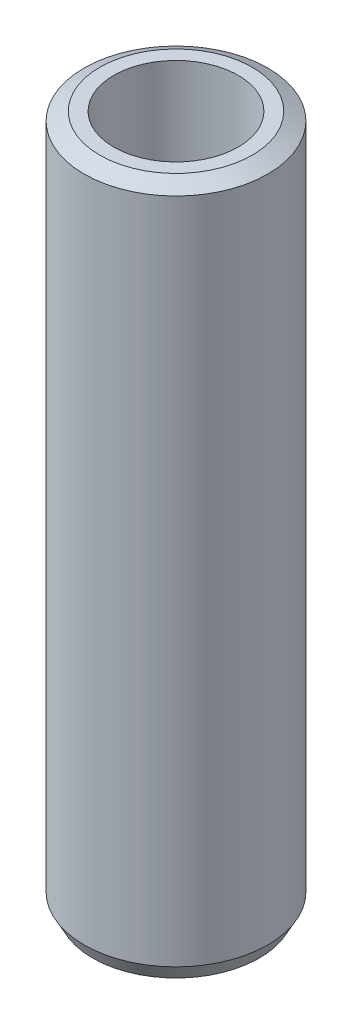
ISO-10303-21;
HEADER;
FILE_DESCRIPTION(('STEP AP214'),'2;1');
FILE_NAME('part.step','',(''),(''),'','','');
FILE_SCHEMA(('AUTOMOTIVE_DESIGN { 1 0 10303 214 1 1 1 1 }'));
ENDSEC;
DATA;
#1=APPLICATION_CONTEXT('core data for automotive mechanical design processes');
#2=APPLICATION_PROTOCOL_DEFINITION('international standard','automotive_design',2000,#1);
#3=PRODUCT_CONTEXT('',#1,'mechanical');
#4=PRODUCT('Part','Part','',(#3));
#5=PRODUCT_RELATED_PRODUCT_CATEGORY('part','',(#4));
#6=PRODUCT_DEFINITION_FORMATION('','',#4);
#7=PRODUCT_DEFINITION_CONTEXT('part definition',#1,'design');
#8=PRODUCT_DEFINITION('design','',#6,#7);
#9=PRODUCT_DEFINITION_SHAPE('','',#8);
#10=(LENGTH_UNIT() NAMED_UNIT(*) SI_UNIT(.MILLI.,.METRE.));
#11=(NAMED_UNIT(*) PLANE_ANGLE_UNIT() SI_UNIT($,.RADIAN.));
#12=(NAMED_UNIT(*) SI_UNIT($,.STERADIAN.) SOLID_ANGLE_UNIT());
#13=UNCERTAINTY_MEASURE_WITH_UNIT(LENGTH_MEASURE(1.E-05),#10,'distance_accuracy_value','');
#14=(GEOMETRIC_REPRESENTATION_CONTEXT(3) GLOBAL_UNCERTAINTY_ASSIGNED_CONTEXT((#13)) GLOBAL_UNIT_ASSIGNED_CONTEXT((#10,
#11,#12)) REPRESENTATION_CONTEXT('',''));
#15=CARTESIAN_POINT('',(0.,0.,0.));
#16=DIRECTION('',(0.,0.,1.));
#17=DIRECTION('',(1.,0.,0.));
#18=AXIS2_PLACEMENT_3D('',#15,#16,#17);
#19=CARTESIAN_POINT('',(0.,432.922423795206,0.));
#20=DIRECTION('',(0.,-1.,0.));
#21=DIRECTION('',(0.,0.,-1.));
#22=AXIS2_PLACEMENT_3D('',#19,#20,#21);
#23=CYLINDRICAL_SURFACE('',#22,57.5);
#24=CARTESIAN_POINT('',(0.,427.605164661149,0.));
#25=DIRECTION('',(0.,1.,0.));
#26=DIRECTION('',(0.,0.,1.));
#27=AXIS2_PLACEMENT_3D('',#24,#25,#26);
#28=CIRCLE('',#27,57.5);
#29=CARTESIAN_POINT('',(0.,427.605164661149,57.5));
#30=VERTEX_POINT('',#29);
#31=EDGE_CURVE('E50',#30,#30,#28,.F.);
#32=ORIENTED_EDGE('',*,*,#31,.T.);
#33=EDGE_LOOP('',(#32));
#34=FACE_BOUND('',#33,.T.);
#35=CARTESIAN_POINT('',(0.,9.80236441677446,0.));
#36=DIRECTION('',(0.,1.,0.));
#37=DIRECTION('',(0.,0.,1.));
#38=AXIS2_PLACEMENT_3D('',#35,#36,#37);
#39=CIRCLE('',#38,57.5);
#40=CARTESIAN_POINT('',(0.,9.80236441677446,57.5));
#41=VERTEX_POINT('',#40);
#42=EDGE_CURVE('E51',#41,#41,#39,.T.);
#43=ORIENTED_EDGE('',*,*,#42,.T.);
#44=EDGE_LOOP('',(#43));
#45=FACE_BOUND('',#44,.T.);
#46=ADVANCED_FACE('F39',(#34,#45),#23,.T.);
#47=CARTESIAN_POINT('',(0.,432.922423795206,0.));
#48=DIRECTION('',(0.,1.,0.));
#49=DIRECTION('',(0.,0.,1.));
#50=AXIS2_PLACEMENT_3D('',#47,#48,#49);
#51=PLANE('',#50);
#52=CARTESIAN_POINT('',(0.,432.922423795206,0.));
#53=DIRECTION('',(0.,1.,0.));
#54=DIRECTION('',(0.,0.,1.));
#55=AXIS2_PLACEMENT_3D('',#52,#53,#54);
#56=CIRCLE('',#55,47.6976355832258);
#57=CARTESIAN_POINT('',(0.,432.922423795206,47.6976355832258));
#58=VERTEX_POINT('',#57);
#59=EDGE_CURVE('E54',#58,#58,#56,.T.);
#60=ORIENTED_EDGE('',*,*,#59,.T.);
#61=EDGE_LOOP('',(#60));
#62=FACE_BOUND('',#61,.T.);
#63=CARTESIAN_POINT('',(0.,432.922423795206,0.));
#64=DIRECTION('',(0.,1.,0.));
#65=DIRECTION('',(0.,0.,1.));
#66=AXIS2_PLACEMENT_3D('',#63,#64,#65);
#67=CIRCLE('',#66,38.9260168679328);
#68=CARTESIAN_POINT('',(0.,432.922423795206,38.9260168679328));
#69=VERTEX_POINT('',#68);
#70=EDGE_CURVE('E58',#69,#69,#67,.T.);
#71=ORIENTED_EDGE('',*,*,#70,.F.);
#72=EDGE_LOOP('',(#71));
#73=FACE_BOUND('',#72,.T.);
#74=ADVANCED_FACE('F69',(#62,#73),#51,.T.);
#75=CARTESIAN_POINT('',(0.,0.,0.));
#76=DIRECTION('',(0.,1.,0.));
#77=DIRECTION('',(0.,0.,1.));
#78=AXIS2_PLACEMENT_3D('',#75,#76,#77);
#79=PLANE('',#78);
#80=CARTESIAN_POINT('',(0.,0.,0.));
#81=DIRECTION('',(0.,1.,0.));
#82=DIRECTION('',(0.,0.,1.));
#83=AXIS2_PLACEMENT_3D('',#80,#81,#82);
#84=CIRCLE('',#83,52.1827408659435);
#85=CARTESIAN_POINT('',(0.,0.,52.1827408659435));
#86=VERTEX_POINT('',#85);
#87=EDGE_CURVE('E10',#86,#86,#84,.F.);
#88=ORIENTED_EDGE('',*,*,#87,.T.);
#89=EDGE_LOOP('',(#88));
#90=FACE_BOUND('',#89,.T.);
#91=CARTESIAN_POINT('',(0.,0.,0.));
#92=DIRECTION('',(0.,1.,0.));
#93=DIRECTION('',(0.,0.,1.));
#94=AXIS2_PLACEMENT_3D('',#91,#92,#93);
#95=CIRCLE('',#94,38.9260168679328);
#96=CARTESIAN_POINT('',(0.,0.,38.9260168679328));
#97=VERTEX_POINT('',#96);
#98=EDGE_CURVE('E63',#97,#97,#95,.T.);
#99=ORIENTED_EDGE('',*,*,#98,.T.);
#100=EDGE_LOOP('',(#99));
#101=FACE_BOUND('',#100,.T.);
#102=ADVANCED_FACE('F75',(#90,#101),#79,.F.);
#103=CARTESIAN_POINT('',(0.,432.922423795206,0.));
#104=DIRECTION('',(0.,-1.,0.));
#105=DIRECTION('',(0.,0.,-1.));
#106=AXIS2_PLACEMENT_3D('',#103,#104,#105);
#107=CYLINDRICAL_SURFACE('',#106,38.9260168679328);
#108=ORIENTED_EDGE('',*,*,#70,.T.);
#109=EDGE_LOOP('',(#108));
#110=FACE_BOUND('',#109,.T.);
#111=ORIENTED_EDGE('',*,*,#98,.F.);
#112=EDGE_LOOP('',(#111));
#113=FACE_BOUND('',#112,.T.);
#114=ADVANCED_FACE('F70',(#110,#113),#107,.F.);
#115=CARTESIAN_POINT('',(0.,432.922423795206,0.));
#116=DIRECTION('',(0.,-1.,0.));
#117=DIRECTION('',(0.,0.,-1.));
#118=AXIS2_PLACEMENT_3D('',#115,#116,#117);
#119=CONICAL_SURFACE('',#118,47.6976355832258,1.07377077062672);
#120=ORIENTED_EDGE('',*,*,#31,.F.);
#121=EDGE_LOOP('',(#120));
#122=FACE_BOUND('',#121,.T.);
#123=ORIENTED_EDGE('',*,*,#59,.F.);
#124=EDGE_LOOP('',(#123));
#125=FACE_BOUND('',#124,.T.);
#126=ADVANCED_FACE('F81',(#122,#125),#119,.T.);
#127=CARTESIAN_POINT('',(0.,9.80236441677446,0.));
#128=DIRECTION('',(0.,1.,0.));
#129=DIRECTION('',(0.,0.,1.));
#130=AXIS2_PLACEMENT_3D('',#127,#128,#129);
#131=CONICAL_SURFACE('',#130,57.5,0.497025556168181);
#132=ORIENTED_EDGE('',*,*,#87,.F.);
#133=EDGE_LOOP('',(#132));
#134=FACE_BOUND('',#133,.T.);
#135=ORIENTED_EDGE('',*,*,#42,.F.);
#136=EDGE_LOOP('',(#135));
#137=FACE_BOUND('',#136,.T.);
#138=ADVANCED_FACE('F45',(#134,#137),#131,.T.);
#139=CLOSED_SHELL('',(#46,#74,#102,#114,#126,#138));
#140=MANIFOLD_SOLID_BREP('B2',#139);
#141=ADVANCED_BREP_SHAPE_REPRESENTATION('',(#18,#140),#14);
#142=SHAPE_DEFINITION_REPRESENTATION(#9,#141);
ENDSEC;
END-ISO-10303-21;
